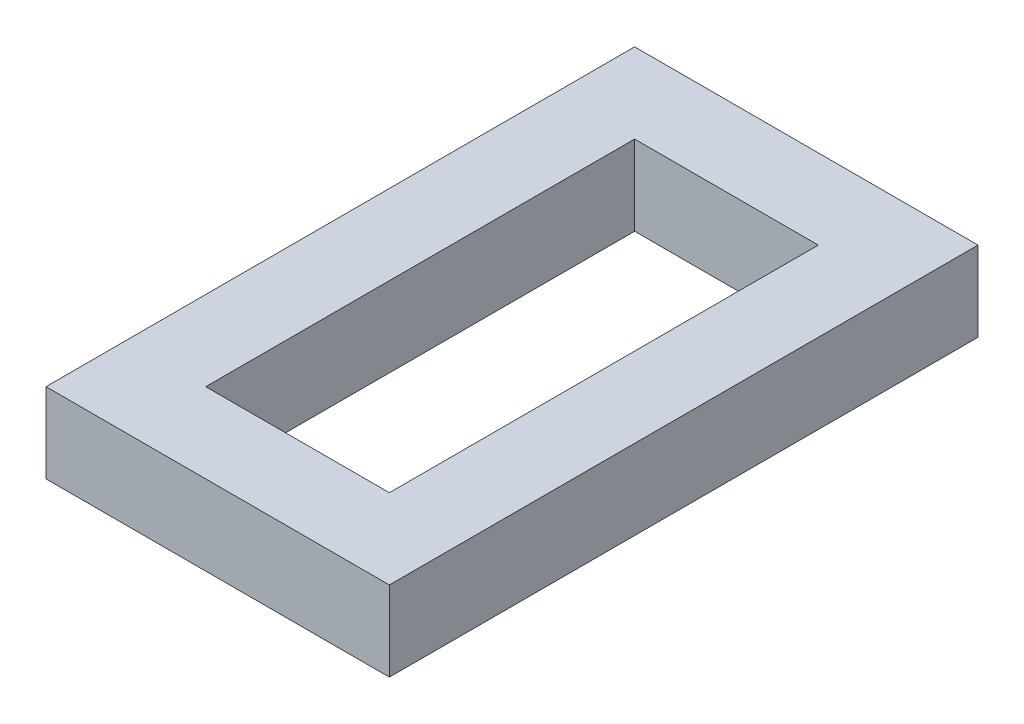
ISO-10303-21;
HEADER;
FILE_DESCRIPTION(('STEP AP214'),'2;1');
FILE_NAME('part.step','',(''),(''),'','','');
FILE_SCHEMA(('AUTOMOTIVE_DESIGN { 1 0 10303 214 1 1 1 1 }'));
ENDSEC;
DATA;
#1=APPLICATION_CONTEXT('core data for automotive mechanical design processes');
#2=APPLICATION_PROTOCOL_DEFINITION('international standard','automotive_design',2000,#1);
#3=PRODUCT_CONTEXT('',#1,'mechanical');
#4=PRODUCT('Part','Part','',(#3));
#5=PRODUCT_RELATED_PRODUCT_CATEGORY('part','',(#4));
#6=PRODUCT_DEFINITION_FORMATION('','',#4);
#7=PRODUCT_DEFINITION_CONTEXT('part definition',#1,'design');
#8=PRODUCT_DEFINITION('design','',#6,#7);
#9=PRODUCT_DEFINITION_SHAPE('','',#8);
#10=(LENGTH_UNIT() NAMED_UNIT(*) SI_UNIT(.MILLI.,.METRE.));
#11=(NAMED_UNIT(*) PLANE_ANGLE_UNIT() SI_UNIT($,.RADIAN.));
#12=(NAMED_UNIT(*) SI_UNIT($,.STERADIAN.) SOLID_ANGLE_UNIT());
#13=UNCERTAINTY_MEASURE_WITH_UNIT(LENGTH_MEASURE(1.E-05),#10,'distance_accuracy_value','');
#14=(GEOMETRIC_REPRESENTATION_CONTEXT(3) GLOBAL_UNCERTAINTY_ASSIGNED_CONTEXT((#13)) GLOBAL_UNIT_ASSIGNED_CONTEXT((#10,
#11,#12)) REPRESENTATION_CONTEXT('',''));
#15=CARTESIAN_POINT('',(0.,0.,0.));
#16=DIRECTION('',(0.,0.,1.));
#17=DIRECTION('',(1.,0.,0.));
#18=AXIS2_PLACEMENT_3D('',#15,#16,#17);
#19=CARTESIAN_POINT('',(0.,15.875,0.));
#20=DIRECTION('',(0.,-1.,0.));
#21=DIRECTION('',(0.,0.,1.));
#22=AXIS2_PLACEMENT_3D('',#19,#20,#21);
#23=PLANE('',#22);
#24=DIRECTION('',(0.,0.,1.));
#25=VECTOR('',#24,1.);
#26=CARTESIAN_POINT('',(34.125,15.875,-58.5));
#27=LINE('',#26,#25);
#28=CARTESIAN_POINT('',(34.125,15.875,-58.5));
#29=VERTEX_POINT('',#28);
#30=CARTESIAN_POINT('',(34.125,15.875,58.5));
#31=VERTEX_POINT('',#30);
#32=EDGE_CURVE('E136',#29,#31,#27,.T.);
#33=ORIENTED_EDGE('',*,*,#32,.F.);
#34=DIRECTION('',(1.,0.,0.));
#35=VECTOR('',#34,1.);
#36=CARTESIAN_POINT('',(-34.125,15.875,-58.5));
#37=LINE('',#36,#35);
#38=CARTESIAN_POINT('',(-34.125,15.875,-58.5));
#39=VERTEX_POINT('',#38);
#40=EDGE_CURVE('E146',#39,#29,#37,.T.);
#41=ORIENTED_EDGE('',*,*,#40,.F.);
#42=DIRECTION('',(0.,0.,-1.));
#43=VECTOR('',#42,1.);
#44=CARTESIAN_POINT('',(-34.125,15.875,-58.5));
#45=LINE('',#44,#43);
#46=CARTESIAN_POINT('',(-34.125,15.875,58.5));
#47=VERTEX_POINT('',#46);
#48=EDGE_CURVE('E143',#47,#39,#45,.T.);
#49=ORIENTED_EDGE('',*,*,#48,.F.);
#50=DIRECTION('',(-1.,0.,0.));
#51=VECTOR('',#50,1.);
#52=CARTESIAN_POINT('',(-34.125,15.875,58.5));
#53=LINE('',#52,#51);
#54=EDGE_CURVE('E139',#31,#47,#53,.T.);
#55=ORIENTED_EDGE('',*,*,#54,.F.);
#56=EDGE_LOOP('',(#33,#41,#49,#55));
#57=FACE_BOUND('',#56,.T.);
#58=DIRECTION('',(1.,0.,0.));
#59=VECTOR('',#58,1.);
#60=CARTESIAN_POINT('',(-18.25,15.875,-42.625));
#61=LINE('',#60,#59);
#62=CARTESIAN_POINT('',(-18.25,15.875,-42.625));
#63=VERTEX_POINT('',#62);
#64=CARTESIAN_POINT('',(18.25,15.875,-42.625));
#65=VERTEX_POINT('',#64);
#66=EDGE_CURVE('E104',#63,#65,#61,.T.);
#67=ORIENTED_EDGE('',*,*,#66,.T.);
#68=DIRECTION('',(0.,0.,1.));
#69=VECTOR('',#68,1.);
#70=CARTESIAN_POINT('',(18.25,15.875,-42.625));
#71=LINE('',#70,#69);
#72=CARTESIAN_POINT('',(18.25,15.875,42.625));
#73=VERTEX_POINT('',#72);
#74=EDGE_CURVE('E113',#65,#73,#71,.T.);
#75=ORIENTED_EDGE('',*,*,#74,.T.);
#76=DIRECTION('',(-1.,0.,0.));
#77=VECTOR('',#76,1.);
#78=CARTESIAN_POINT('',(-18.25,15.875,42.625));
#79=LINE('',#78,#77);
#80=CARTESIAN_POINT('',(-18.25,15.875,42.625));
#81=VERTEX_POINT('',#80);
#82=EDGE_CURVE('E117',#73,#81,#79,.T.);
#83=ORIENTED_EDGE('',*,*,#82,.T.);
#84=DIRECTION('',(0.,0.,-1.));
#85=VECTOR('',#84,1.);
#86=CARTESIAN_POINT('',(-18.25,15.875,-42.625));
#87=LINE('',#86,#85);
#88=EDGE_CURVE('E120',#81,#63,#87,.T.);
#89=ORIENTED_EDGE('',*,*,#88,.T.);
#90=EDGE_LOOP('',(#67,#75,#83,#89));
#91=FACE_BOUND('',#90,.T.);
#92=ADVANCED_FACE('F37',(#57,#91),#23,.F.);
#93=CARTESIAN_POINT('',(0.,0.,0.));
#94=DIRECTION('',(0.,-1.,0.));
#95=DIRECTION('',(0.,0.,1.));
#96=AXIS2_PLACEMENT_3D('',#93,#94,#95);
#97=PLANE('',#96);
#98=DIRECTION('',(0.,0.,1.));
#99=VECTOR('',#98,1.);
#100=CARTESIAN_POINT('',(34.125,0.,-58.5));
#101=LINE('',#100,#99);
#102=CARTESIAN_POINT('',(34.125,0.,-58.5));
#103=VERTEX_POINT('',#102);
#104=CARTESIAN_POINT('',(34.125,0.,58.5));
#105=VERTEX_POINT('',#104);
#106=EDGE_CURVE('E109',#103,#105,#101,.T.);
#107=ORIENTED_EDGE('',*,*,#106,.T.);
#108=DIRECTION('',(-1.,0.,0.));
#109=VECTOR('',#108,1.);
#110=CARTESIAN_POINT('',(-34.125,0.,58.5));
#111=LINE('',#110,#109);
#112=CARTESIAN_POINT('',(-34.125,0.,58.5));
#113=VERTEX_POINT('',#112);
#114=EDGE_CURVE('E152',#105,#113,#111,.T.);
#115=ORIENTED_EDGE('',*,*,#114,.T.);
#116=DIRECTION('',(0.,0.,-1.));
#117=VECTOR('',#116,1.);
#118=CARTESIAN_POINT('',(-34.125,0.,-58.5));
#119=LINE('',#118,#117);
#120=CARTESIAN_POINT('',(-34.125,0.,-58.5));
#121=VERTEX_POINT('',#120);
#122=EDGE_CURVE('E155',#113,#121,#119,.T.);
#123=ORIENTED_EDGE('',*,*,#122,.T.);
#124=DIRECTION('',(1.,0.,0.));
#125=VECTOR('',#124,1.);
#126=CARTESIAN_POINT('',(-34.125,0.,-58.5));
#127=LINE('',#126,#125);
#128=EDGE_CURVE('E140',#121,#103,#127,.T.);
#129=ORIENTED_EDGE('',*,*,#128,.T.);
#130=EDGE_LOOP('',(#107,#115,#123,#129));
#131=FACE_BOUND('',#130,.T.);
#132=DIRECTION('',(0.,0.,-1.));
#133=VECTOR('',#132,1.);
#134=CARTESIAN_POINT('',(-18.25,0.,-42.625));
#135=LINE('',#134,#133);
#136=CARTESIAN_POINT('',(-18.25,0.,42.625));
#137=VERTEX_POINT('',#136);
#138=CARTESIAN_POINT('',(-18.25,0.,-42.625));
#139=VERTEX_POINT('',#138);
#140=EDGE_CURVE('E121',#137,#139,#135,.T.);
#141=ORIENTED_EDGE('',*,*,#140,.F.);
#142=DIRECTION('',(-1.,0.,0.));
#143=VECTOR('',#142,1.);
#144=CARTESIAN_POINT('',(-18.25,0.,42.625));
#145=LINE('',#144,#143);
#146=CARTESIAN_POINT('',(18.25,0.,42.625));
#147=VERTEX_POINT('',#146);
#148=EDGE_CURVE('E124',#147,#137,#145,.T.);
#149=ORIENTED_EDGE('',*,*,#148,.F.);
#150=DIRECTION('',(0.,0.,1.));
#151=VECTOR('',#150,1.);
#152=CARTESIAN_POINT('',(18.25,0.,-42.625));
#153=LINE('',#152,#151);
#154=CARTESIAN_POINT('',(18.25,0.,-42.625));
#155=VERTEX_POINT('',#154);
#156=EDGE_CURVE('E130',#155,#147,#153,.T.);
#157=ORIENTED_EDGE('',*,*,#156,.F.);
#158=DIRECTION('',(1.,0.,0.));
#159=VECTOR('',#158,1.);
#160=CARTESIAN_POINT('',(-18.25,0.,-42.625));
#161=LINE('',#160,#159);
#162=EDGE_CURVE('E105',#139,#155,#161,.T.);
#163=ORIENTED_EDGE('',*,*,#162,.F.);
#164=EDGE_LOOP('',(#141,#149,#157,#163));
#165=FACE_BOUND('',#164,.T.);
#166=ADVANCED_FACE('F172',(#131,#165),#97,.T.);
#167=CARTESIAN_POINT('',(34.125,15.875,-58.5));
#168=DIRECTION('',(-1.,0.,0.));
#169=DIRECTION('',(0.,0.,-1.));
#170=AXIS2_PLACEMENT_3D('',#167,#168,#169);
#171=PLANE('',#170);
#172=ORIENTED_EDGE('',*,*,#106,.F.);
#173=DIRECTION('',(0.,-1.,0.));
#174=VECTOR('',#173,1.);
#175=CARTESIAN_POINT('',(34.125,15.875,-58.5));
#176=LINE('',#175,#174);
#177=EDGE_CURVE('E149',#29,#103,#176,.T.);
#178=ORIENTED_EDGE('',*,*,#177,.F.);
#179=ORIENTED_EDGE('',*,*,#32,.T.);
#180=DIRECTION('',(0.,-1.,0.));
#181=VECTOR('',#180,1.);
#182=CARTESIAN_POINT('',(34.125,15.875,58.5));
#183=LINE('',#182,#181);
#184=EDGE_CURVE('E11',#31,#105,#183,.T.);
#185=ORIENTED_EDGE('',*,*,#184,.T.);
#186=EDGE_LOOP('',(#172,#178,#179,#185));
#187=FACE_BOUND('',#186,.T.);
#188=ADVANCED_FACE('F39',(#187),#171,.F.);
#189=CARTESIAN_POINT('',(-34.125,15.875,58.5));
#190=DIRECTION('',(0.,0.,-1.));
#191=DIRECTION('',(1.,0.,0.));
#192=AXIS2_PLACEMENT_3D('',#189,#190,#191);
#193=PLANE('',#192);
#194=ORIENTED_EDGE('',*,*,#114,.F.);
#195=ORIENTED_EDGE('',*,*,#184,.F.);
#196=ORIENTED_EDGE('',*,*,#54,.T.);
#197=DIRECTION('',(0.,-1.,0.));
#198=VECTOR('',#197,1.);
#199=CARTESIAN_POINT('',(-34.125,15.875,58.5));
#200=LINE('',#199,#198);
#201=EDGE_CURVE('E45',#47,#113,#200,.T.);
#202=ORIENTED_EDGE('',*,*,#201,.T.);
#203=EDGE_LOOP('',(#194,#195,#196,#202));
#204=FACE_BOUND('',#203,.T.);
#205=ADVANCED_FACE('F165',(#204),#193,.F.);
#206=CARTESIAN_POINT('',(-34.125,15.875,-58.5));
#207=DIRECTION('',(1.,0.,0.));
#208=DIRECTION('',(0.,0.,1.));
#209=AXIS2_PLACEMENT_3D('',#206,#207,#208);
#210=PLANE('',#209);
#211=ORIENTED_EDGE('',*,*,#122,.F.);
#212=ORIENTED_EDGE('',*,*,#201,.F.);
#213=ORIENTED_EDGE('',*,*,#48,.T.);
#214=DIRECTION('',(0.,-1.,0.));
#215=VECTOR('',#214,1.);
#216=CARTESIAN_POINT('',(-34.125,15.875,-58.5));
#217=LINE('',#216,#215);
#218=EDGE_CURVE('E161',#39,#121,#217,.T.);
#219=ORIENTED_EDGE('',*,*,#218,.T.);
#220=EDGE_LOOP('',(#211,#212,#213,#219));
#221=FACE_BOUND('',#220,.T.);
#222=ADVANCED_FACE('F169',(#221),#210,.F.);
#223=CARTESIAN_POINT('',(-34.125,15.875,-58.5));
#224=DIRECTION('',(0.,0.,1.));
#225=DIRECTION('',(-1.,0.,0.));
#226=AXIS2_PLACEMENT_3D('',#223,#224,#225);
#227=PLANE('',#226);
#228=ORIENTED_EDGE('',*,*,#128,.F.);
#229=ORIENTED_EDGE('',*,*,#218,.F.);
#230=ORIENTED_EDGE('',*,*,#40,.T.);
#231=ORIENTED_EDGE('',*,*,#177,.T.);
#232=EDGE_LOOP('',(#228,#229,#230,#231));
#233=FACE_BOUND('',#232,.T.);
#234=ADVANCED_FACE('F180',(#233),#227,.F.);
#235=CARTESIAN_POINT('',(-18.25,15.875,-42.625));
#236=DIRECTION('',(0.,0.,1.));
#237=DIRECTION('',(-1.,0.,0.));
#238=AXIS2_PLACEMENT_3D('',#235,#236,#237);
#239=PLANE('',#238);
#240=ORIENTED_EDGE('',*,*,#162,.T.);
#241=DIRECTION('',(0.,-1.,0.));
#242=VECTOR('',#241,1.);
#243=CARTESIAN_POINT('',(18.25,15.875,-42.625));
#244=LINE('',#243,#242);
#245=EDGE_CURVE('E100',#65,#155,#244,.T.);
#246=ORIENTED_EDGE('',*,*,#245,.F.);
#247=ORIENTED_EDGE('',*,*,#66,.F.);
#248=DIRECTION('',(0.,-1.,0.));
#249=VECTOR('',#248,1.);
#250=CARTESIAN_POINT('',(-18.25,15.875,-42.625));
#251=LINE('',#250,#249);
#252=EDGE_CURVE('E60',#63,#139,#251,.T.);
#253=ORIENTED_EDGE('',*,*,#252,.T.);
#254=EDGE_LOOP('',(#240,#246,#247,#253));
#255=FACE_BOUND('',#254,.T.);
#256=ADVANCED_FACE('F102',(#255),#239,.T.);
#257=CARTESIAN_POINT('',(18.25,15.875,-42.625));
#258=DIRECTION('',(-1.,0.,0.));
#259=DIRECTION('',(0.,0.,-1.));
#260=AXIS2_PLACEMENT_3D('',#257,#258,#259);
#261=PLANE('',#260);
#262=ORIENTED_EDGE('',*,*,#156,.T.);
#263=DIRECTION('',(0.,-1.,0.));
#264=VECTOR('',#263,1.);
#265=CARTESIAN_POINT('',(18.25,15.875,42.625));
#266=LINE('',#265,#264);
#267=EDGE_CURVE('E110',#73,#147,#266,.T.);
#268=ORIENTED_EDGE('',*,*,#267,.F.);
#269=ORIENTED_EDGE('',*,*,#74,.F.);
#270=ORIENTED_EDGE('',*,*,#245,.T.);
#271=EDGE_LOOP('',(#262,#268,#269,#270));
#272=FACE_BOUND('',#271,.T.);
#273=ADVANCED_FACE('F114',(#272),#261,.T.);
#274=CARTESIAN_POINT('',(-18.25,15.875,42.625));
#275=DIRECTION('',(0.,0.,-1.));
#276=DIRECTION('',(1.,0.,0.));
#277=AXIS2_PLACEMENT_3D('',#274,#275,#276);
#278=PLANE('',#277);
#279=ORIENTED_EDGE('',*,*,#148,.T.);
#280=DIRECTION('',(0.,-1.,0.));
#281=VECTOR('',#280,1.);
#282=CARTESIAN_POINT('',(-18.25,15.875,42.625));
#283=LINE('',#282,#281);
#284=EDGE_CURVE('E52',#81,#137,#283,.T.);
#285=ORIENTED_EDGE('',*,*,#284,.F.);
#286=ORIENTED_EDGE('',*,*,#82,.F.);
#287=ORIENTED_EDGE('',*,*,#267,.T.);
#288=EDGE_LOOP('',(#279,#285,#286,#287));
#289=FACE_BOUND('',#288,.T.);
#290=ADVANCED_FACE('F198',(#289),#278,.T.);
#291=CARTESIAN_POINT('',(-18.25,15.875,-42.625));
#292=DIRECTION('',(1.,0.,0.));
#293=DIRECTION('',(0.,0.,1.));
#294=AXIS2_PLACEMENT_3D('',#291,#292,#293);
#295=PLANE('',#294);
#296=ORIENTED_EDGE('',*,*,#140,.T.);
#297=ORIENTED_EDGE('',*,*,#252,.F.);
#298=ORIENTED_EDGE('',*,*,#88,.F.);
#299=ORIENTED_EDGE('',*,*,#284,.T.);
#300=EDGE_LOOP('',(#296,#297,#298,#299));
#301=FACE_BOUND('',#300,.T.);
#302=ADVANCED_FACE('F201',(#301),#295,.T.);
#303=CLOSED_SHELL('',(#92,#166,#188,#205,#222,#234,#256,#273,#290,#302));
#304=MANIFOLD_SOLID_BREP('B2',#303);
#305=ADVANCED_BREP_SHAPE_REPRESENTATION('',(#18,#304),#14);
#306=SHAPE_DEFINITION_REPRESENTATION(#9,#305);
ENDSEC;
END-ISO-10303-21;
